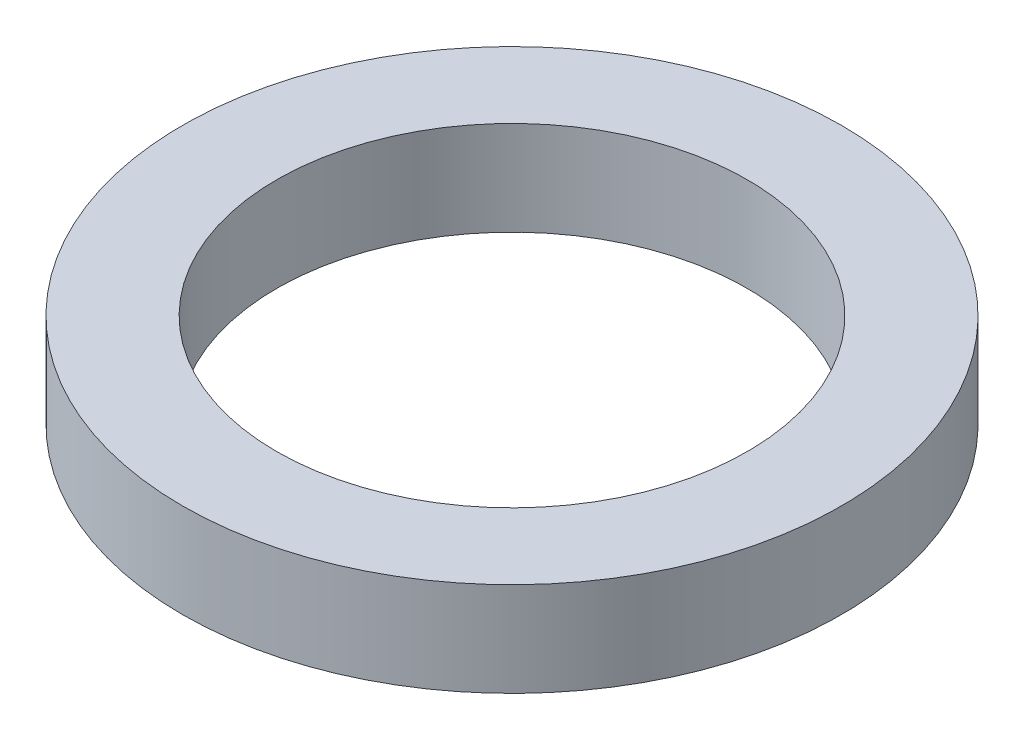
ISO-10303-21;
HEADER;
FILE_DESCRIPTION(('STEP AP214'),'2;1');
FILE_NAME('part.step','',(''),(''),'','','');
FILE_SCHEMA(('AUTOMOTIVE_DESIGN { 1 0 10303 214 1 1 1 1 }'));
ENDSEC;
DATA;
#1=APPLICATION_CONTEXT('core data for automotive mechanical design processes');
#2=APPLICATION_PROTOCOL_DEFINITION('international standard','automotive_design',2000,#1);
#3=PRODUCT_CONTEXT('',#1,'mechanical');
#4=PRODUCT('Part','Part','',(#3));
#5=PRODUCT_RELATED_PRODUCT_CATEGORY('part','',(#4));
#6=PRODUCT_DEFINITION_FORMATION('','',#4);
#7=PRODUCT_DEFINITION_CONTEXT('part definition',#1,'design');
#8=PRODUCT_DEFINITION('design','',#6,#7);
#9=PRODUCT_DEFINITION_SHAPE('','',#8);
#10=(LENGTH_UNIT() NAMED_UNIT(*) SI_UNIT(.MILLI.,.METRE.));
#11=(NAMED_UNIT(*) PLANE_ANGLE_UNIT() SI_UNIT($,.RADIAN.));
#12=(NAMED_UNIT(*) SI_UNIT($,.STERADIAN.) SOLID_ANGLE_UNIT());
#13=UNCERTAINTY_MEASURE_WITH_UNIT(LENGTH_MEASURE(1.E-05),#10,'distance_accuracy_value','');
#14=(GEOMETRIC_REPRESENTATION_CONTEXT(3) GLOBAL_UNCERTAINTY_ASSIGNED_CONTEXT((#13)) GLOBAL_UNIT_ASSIGNED_CONTEXT((#10,
#11,#12)) REPRESENTATION_CONTEXT('',''));
#15=CARTESIAN_POINT('',(0.,0.,0.));
#16=DIRECTION('',(0.,0.,1.));
#17=DIRECTION('',(1.,0.,0.));
#18=AXIS2_PLACEMENT_3D('',#15,#16,#17);
#19=CARTESIAN_POINT('',(0.,10.,0.));
#20=DIRECTION('',(0.,1.,0.));
#21=DIRECTION('',(0.,0.,1.));
#22=AXIS2_PLACEMENT_3D('',#19,#20,#21);
#23=PLANE('',#22);
#24=CARTESIAN_POINT('',(0.,10.,0.));
#25=DIRECTION('',(0.,1.,0.));
#26=DIRECTION('',(0.,0.,1.));
#27=AXIS2_PLACEMENT_3D('',#24,#25,#26);
#28=CIRCLE('',#27,35.);
#29=CARTESIAN_POINT('',(0.,10.,35.));
#30=VERTEX_POINT('',#29);
#31=EDGE_CURVE('E10',#30,#30,#28,.T.);
#32=ORIENTED_EDGE('',*,*,#31,.T.);
#33=EDGE_LOOP('',(#32));
#34=FACE_BOUND('',#33,.T.);
#35=CARTESIAN_POINT('',(0.,10.,0.));
#36=DIRECTION('',(0.,1.,0.));
#37=DIRECTION('',(0.,0.,1.));
#38=AXIS2_PLACEMENT_3D('',#35,#36,#37);
#39=CIRCLE('',#38,25.);
#40=CARTESIAN_POINT('',(0.,10.,25.));
#41=VERTEX_POINT('',#40);
#42=EDGE_CURVE('E42',#41,#41,#39,.T.);
#43=ORIENTED_EDGE('',*,*,#42,.F.);
#44=EDGE_LOOP('',(#43));
#45=FACE_BOUND('',#44,.T.);
#46=ADVANCED_FACE('F31',(#34,#45),#23,.T.);
#47=CARTESIAN_POINT('',(0.,0.,0.));
#48=DIRECTION('',(0.,1.,0.));
#49=DIRECTION('',(0.,0.,1.));
#50=AXIS2_PLACEMENT_3D('',#47,#48,#49);
#51=PLANE('',#50);
#52=CARTESIAN_POINT('',(0.,0.,0.));
#53=DIRECTION('',(0.,1.,0.));
#54=DIRECTION('',(0.,0.,1.));
#55=AXIS2_PLACEMENT_3D('',#52,#53,#54);
#56=CIRCLE('',#55,35.);
#57=CARTESIAN_POINT('',(0.,0.,35.));
#58=VERTEX_POINT('',#57);
#59=EDGE_CURVE('E35',#58,#58,#56,.T.);
#60=ORIENTED_EDGE('',*,*,#59,.F.);
#61=EDGE_LOOP('',(#60));
#62=FACE_BOUND('',#61,.T.);
#63=CARTESIAN_POINT('',(0.,0.,0.));
#64=DIRECTION('',(0.,1.,0.));
#65=DIRECTION('',(0.,0.,1.));
#66=AXIS2_PLACEMENT_3D('',#63,#64,#65);
#67=CIRCLE('',#66,25.);
#68=CARTESIAN_POINT('',(0.,0.,25.));
#69=VERTEX_POINT('',#68);
#70=EDGE_CURVE('E44',#69,#69,#67,.T.);
#71=ORIENTED_EDGE('',*,*,#70,.T.);
#72=EDGE_LOOP('',(#71));
#73=FACE_BOUND('',#72,.T.);
#74=ADVANCED_FACE('F54',(#62,#73),#51,.F.);
#75=CARTESIAN_POINT('',(0.,10.,0.));
#76=DIRECTION('',(0.,-1.,0.));
#77=DIRECTION('',(0.,0.,-1.));
#78=AXIS2_PLACEMENT_3D('',#75,#76,#77);
#79=CYLINDRICAL_SURFACE('',#78,35.);
#80=ORIENTED_EDGE('',*,*,#31,.F.);
#81=EDGE_LOOP('',(#80));
#82=FACE_BOUND('',#81,.T.);
#83=ORIENTED_EDGE('',*,*,#59,.T.);
#84=EDGE_LOOP('',(#83));
#85=FACE_BOUND('',#84,.T.);
#86=ADVANCED_FACE('F33',(#82,#85),#79,.T.);
#87=CARTESIAN_POINT('',(0.,10.,0.));
#88=DIRECTION('',(0.,-1.,0.));
#89=DIRECTION('',(0.,0.,-1.));
#90=AXIS2_PLACEMENT_3D('',#87,#88,#89);
#91=CYLINDRICAL_SURFACE('',#90,25.);
#92=ORIENTED_EDGE('',*,*,#42,.T.);
#93=EDGE_LOOP('',(#92));
#94=FACE_BOUND('',#93,.T.);
#95=ORIENTED_EDGE('',*,*,#70,.F.);
#96=EDGE_LOOP('',(#95));
#97=FACE_BOUND('',#96,.T.);
#98=ADVANCED_FACE('F50',(#94,#97),#91,.F.);
#99=CLOSED_SHELL('',(#46,#74,#86,#98));
#100=MANIFOLD_SOLID_BREP('B2',#99);
#101=ADVANCED_BREP_SHAPE_REPRESENTATION('',(#18,#100),#14);
#102=SHAPE_DEFINITION_REPRESENTATION(#9,#101);
ENDSEC;
END-ISO-10303-21;
